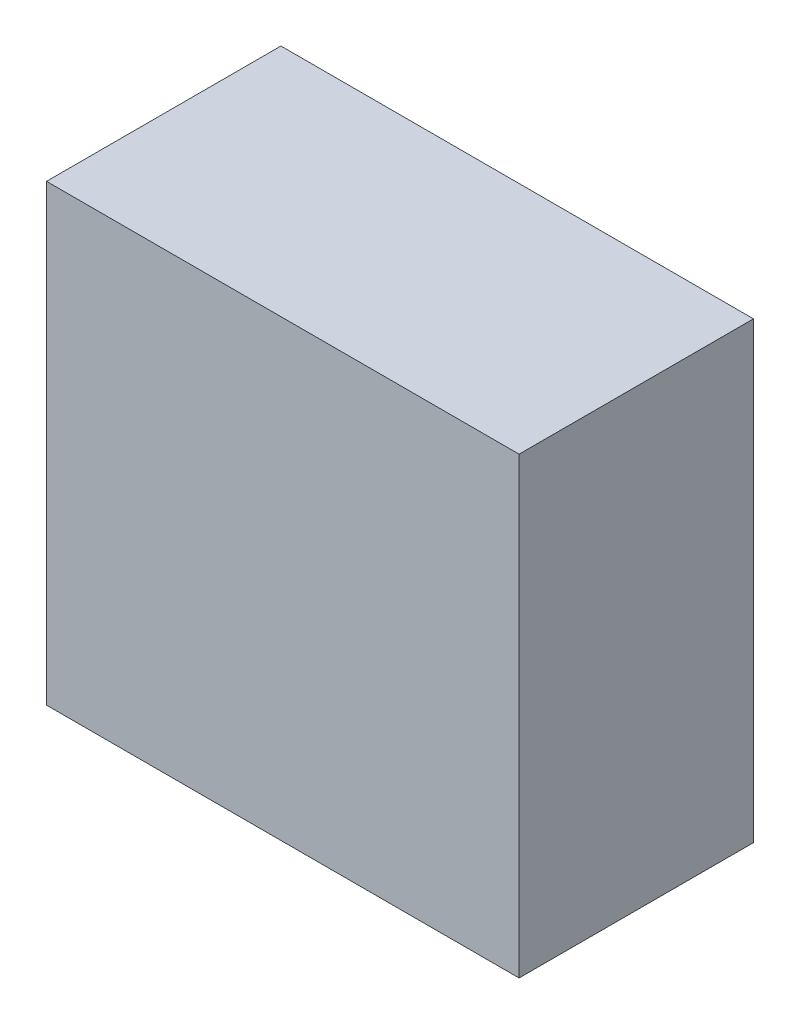
ISO-10303-21;
HEADER;
FILE_DESCRIPTION(('STEP AP214'),'2;1');
FILE_NAME('part.step','',(''),(''),'','','');
FILE_SCHEMA(('AUTOMOTIVE_DESIGN { 1 0 10303 214 1 1 1 1 }'));
ENDSEC;
DATA;
#1=APPLICATION_CONTEXT('core data for automotive mechanical design processes');
#2=APPLICATION_PROTOCOL_DEFINITION('international standard','automotive_design',2000,#1);
#3=PRODUCT_CONTEXT('',#1,'mechanical');
#4=PRODUCT('Part','Part','',(#3));
#5=PRODUCT_RELATED_PRODUCT_CATEGORY('part','',(#4));
#6=PRODUCT_DEFINITION_FORMATION('','',#4);
#7=PRODUCT_DEFINITION_CONTEXT('part definition',#1,'design');
#8=PRODUCT_DEFINITION('design','',#6,#7);
#9=PRODUCT_DEFINITION_SHAPE('','',#8);
#10=(LENGTH_UNIT() NAMED_UNIT(*) SI_UNIT(.MILLI.,.METRE.));
#11=(NAMED_UNIT(*) PLANE_ANGLE_UNIT() SI_UNIT($,.RADIAN.));
#12=(NAMED_UNIT(*) SI_UNIT($,.STERADIAN.) SOLID_ANGLE_UNIT());
#13=UNCERTAINTY_MEASURE_WITH_UNIT(LENGTH_MEASURE(1.E-05),#10,'distance_accuracy_value','');
#14=(GEOMETRIC_REPRESENTATION_CONTEXT(3) GLOBAL_UNCERTAINTY_ASSIGNED_CONTEXT((#13)) GLOBAL_UNIT_ASSIGNED_CONTEXT((#10,
#11,#12)) REPRESENTATION_CONTEXT('',''));
#15=CARTESIAN_POINT('',(0.,0.,0.));
#16=DIRECTION('',(0.,0.,1.));
#17=DIRECTION('',(1.,0.,0.));
#18=AXIS2_PLACEMENT_3D('',#15,#16,#17);
#19=CARTESIAN_POINT('',(0.,3.048,0.));
#20=DIRECTION('',(1.,0.,0.));
#21=DIRECTION('',(0.,0.,-1.));
#22=AXIS2_PLACEMENT_3D('',#19,#20,#21);
#23=PLANE('',#22);
#24=DIRECTION('',(0.,0.,1.));
#25=VECTOR('',#24,1.);
#26=CARTESIAN_POINT('',(0.,0.,0.));
#27=LINE('',#26,#25);
#28=CARTESIAN_POINT('',(0.,0.,-1.5748));
#29=VERTEX_POINT('',#28);
#30=CARTESIAN_POINT('',(0.,0.,0.));
#31=VERTEX_POINT('',#30);
#32=EDGE_CURVE('E98',#29,#31,#27,.T.);
#33=ORIENTED_EDGE('',*,*,#32,.T.);
#34=DIRECTION('',(0.,-1.,0.));
#35=VECTOR('',#34,1.);
#36=CARTESIAN_POINT('',(0.,3.048,0.));
#37=LINE('',#36,#35);
#38=CARTESIAN_POINT('',(0.,3.048,0.));
#39=VERTEX_POINT('',#38);
#40=EDGE_CURVE('E11',#39,#31,#37,.T.);
#41=ORIENTED_EDGE('',*,*,#40,.F.);
#42=DIRECTION('',(0.,0.,1.));
#43=VECTOR('',#42,1.);
#44=CARTESIAN_POINT('',(0.,3.048,0.));
#45=LINE('',#44,#43);
#46=CARTESIAN_POINT('',(0.,3.048,-1.5748));
#47=VERTEX_POINT('',#46);
#48=EDGE_CURVE('E86',#47,#39,#45,.T.);
#49=ORIENTED_EDGE('',*,*,#48,.F.);
#50=DIRECTION('',(0.,-1.,0.));
#51=VECTOR('',#50,1.);
#52=CARTESIAN_POINT('',(0.,3.048,-1.5748));
#53=LINE('',#52,#51);
#54=EDGE_CURVE('E94',#47,#29,#53,.T.);
#55=ORIENTED_EDGE('',*,*,#54,.T.);
#56=EDGE_LOOP('',(#33,#41,#49,#55));
#57=FACE_BOUND('',#56,.T.);
#58=ADVANCED_FACE('F35',(#57),#23,.F.);
#59=CARTESIAN_POINT('',(0.,3.048,0.));
#60=DIRECTION('',(0.,0.,-1.));
#61=DIRECTION('',(-1.,0.,0.));
#62=AXIS2_PLACEMENT_3D('',#59,#60,#61);
#63=PLANE('',#62);
#64=DIRECTION('',(1.,0.,0.));
#65=VECTOR('',#64,1.);
#66=CARTESIAN_POINT('',(0.,0.,0.));
#67=LINE('',#66,#65);
#68=CARTESIAN_POINT('',(3.175,0.,0.));
#69=VERTEX_POINT('',#68);
#70=EDGE_CURVE('E90',#31,#69,#67,.T.);
#71=ORIENTED_EDGE('',*,*,#70,.T.);
#72=DIRECTION('',(0.,-1.,0.));
#73=VECTOR('',#72,1.);
#74=CARTESIAN_POINT('',(3.175,3.048,0.));
#75=LINE('',#74,#73);
#76=CARTESIAN_POINT('',(3.175,3.048,0.));
#77=VERTEX_POINT('',#76);
#78=EDGE_CURVE('E43',#77,#69,#75,.T.);
#79=ORIENTED_EDGE('',*,*,#78,.F.);
#80=DIRECTION('',(1.,0.,0.));
#81=VECTOR('',#80,1.);
#82=CARTESIAN_POINT('',(0.,3.048,0.));
#83=LINE('',#82,#81);
#84=EDGE_CURVE('E81',#39,#77,#83,.T.);
#85=ORIENTED_EDGE('',*,*,#84,.F.);
#86=ORIENTED_EDGE('',*,*,#40,.T.);
#87=EDGE_LOOP('',(#71,#79,#85,#86));
#88=FACE_BOUND('',#87,.T.);
#89=ADVANCED_FACE('F89',(#88),#63,.F.);
#90=CARTESIAN_POINT('',(3.175,3.048,0.));
#91=DIRECTION('',(-1.,0.,0.));
#92=DIRECTION('',(0.,0.,1.));
#93=AXIS2_PLACEMENT_3D('',#90,#91,#92);
#94=PLANE('',#93);
#95=DIRECTION('',(0.,0.,-1.));
#96=VECTOR('',#95,1.);
#97=CARTESIAN_POINT('',(3.175,0.,0.));
#98=LINE('',#97,#96);
#99=CARTESIAN_POINT('',(3.175,0.,-1.5748));
#100=VERTEX_POINT('',#99);
#101=EDGE_CURVE('E68',#69,#100,#98,.T.);
#102=ORIENTED_EDGE('',*,*,#101,.T.);
#103=DIRECTION('',(0.,-1.,0.));
#104=VECTOR('',#103,1.);
#105=CARTESIAN_POINT('',(3.175,3.048,-1.5748));
#106=LINE('',#105,#104);
#107=CARTESIAN_POINT('',(3.175,3.048,-1.5748));
#108=VERTEX_POINT('',#107);
#109=EDGE_CURVE('E91',#108,#100,#106,.T.);
#110=ORIENTED_EDGE('',*,*,#109,.F.);
#111=DIRECTION('',(0.,0.,-1.));
#112=VECTOR('',#111,1.);
#113=CARTESIAN_POINT('',(3.175,3.048,0.));
#114=LINE('',#113,#112);
#115=EDGE_CURVE('E84',#77,#108,#114,.T.);
#116=ORIENTED_EDGE('',*,*,#115,.F.);
#117=ORIENTED_EDGE('',*,*,#78,.T.);
#118=EDGE_LOOP('',(#102,#110,#116,#117));
#119=FACE_BOUND('',#118,.T.);
#120=ADVANCED_FACE('F92',(#119),#94,.F.);
#121=CARTESIAN_POINT('',(0.,3.048,-1.5748));
#122=DIRECTION('',(0.,0.,1.));
#123=DIRECTION('',(1.,0.,0.));
#124=AXIS2_PLACEMENT_3D('',#121,#122,#123);
#125=PLANE('',#124);
#126=DIRECTION('',(-1.,0.,0.));
#127=VECTOR('',#126,1.);
#128=CARTESIAN_POINT('',(0.,0.,-1.5748));
#129=LINE('',#128,#127);
#130=EDGE_CURVE('E74',#100,#29,#129,.T.);
#131=ORIENTED_EDGE('',*,*,#130,.T.);
#132=ORIENTED_EDGE('',*,*,#54,.F.);
#133=DIRECTION('',(-1.,0.,0.));
#134=VECTOR('',#133,1.);
#135=CARTESIAN_POINT('',(0.,3.048,-1.5748));
#136=LINE('',#135,#134);
#137=EDGE_CURVE('E51',#108,#47,#136,.T.);
#138=ORIENTED_EDGE('',*,*,#137,.F.);
#139=ORIENTED_EDGE('',*,*,#109,.T.);
#140=EDGE_LOOP('',(#131,#132,#138,#139));
#141=FACE_BOUND('',#140,.T.);
#142=ADVANCED_FACE('F105',(#141),#125,.F.);
#143=CARTESIAN_POINT('',(0.,3.048,0.));
#144=DIRECTION('',(0.,-1.,0.));
#145=DIRECTION('',(0.,0.,-1.));
#146=AXIS2_PLACEMENT_3D('',#143,#144,#145);
#147=PLANE('',#146);
#148=ORIENTED_EDGE('',*,*,#48,.T.);
#149=ORIENTED_EDGE('',*,*,#84,.T.);
#150=ORIENTED_EDGE('',*,*,#115,.T.);
#151=ORIENTED_EDGE('',*,*,#137,.T.);
#152=EDGE_LOOP('',(#148,#149,#150,#151));
#153=FACE_BOUND('',#152,.T.);
#154=ADVANCED_FACE('F82',(#153),#147,.F.);
#155=CARTESIAN_POINT('',(0.,0.,0.));
#156=DIRECTION('',(0.,-1.,0.));
#157=DIRECTION('',(0.,0.,-1.));
#158=AXIS2_PLACEMENT_3D('',#155,#156,#157);
#159=PLANE('',#158);
#160=ORIENTED_EDGE('',*,*,#32,.F.);
#161=ORIENTED_EDGE('',*,*,#130,.F.);
#162=ORIENTED_EDGE('',*,*,#101,.F.);
#163=ORIENTED_EDGE('',*,*,#70,.F.);
#164=EDGE_LOOP('',(#160,#161,#162,#163));
#165=FACE_BOUND('',#164,.T.);
#166=ADVANCED_FACE('F108',(#165),#159,.T.);
#167=CLOSED_SHELL('',(#58,#89,#120,#142,#154,#166));
#168=MANIFOLD_SOLID_BREP('B2',#167);
#169=ADVANCED_BREP_SHAPE_REPRESENTATION('',(#18,#168),#14);
#170=SHAPE_DEFINITION_REPRESENTATION(#9,#169);
ENDSEC;
END-ISO-10303-21;
